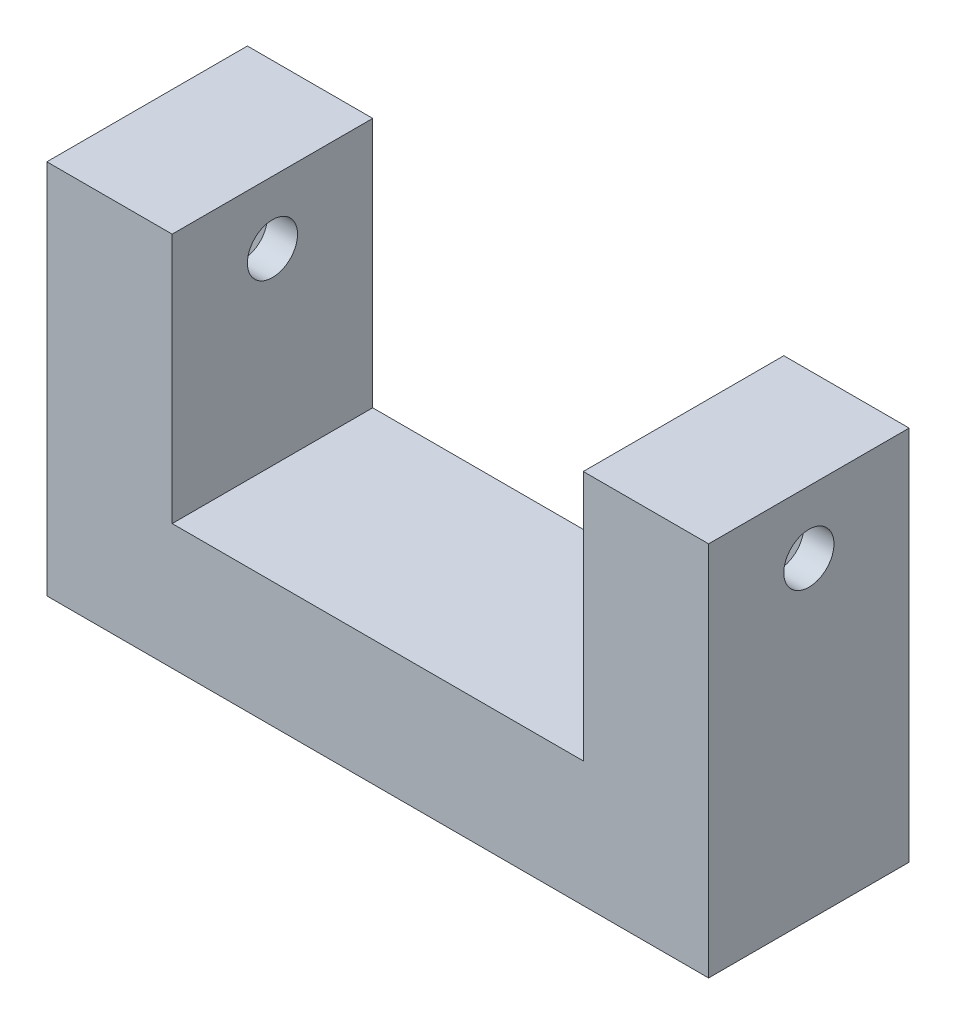
ISO-10303-21;
HEADER;
FILE_DESCRIPTION(('STEP AP214'),'2;1');
FILE_NAME('part.step','',(''),(''),'','','');
FILE_SCHEMA(('AUTOMOTIVE_DESIGN { 1 0 10303 214 1 1 1 1 }'));
ENDSEC;
DATA;
#1=APPLICATION_CONTEXT('core data for automotive mechanical design processes');
#2=APPLICATION_PROTOCOL_DEFINITION('international standard','automotive_design',2000,#1);
#3=PRODUCT_CONTEXT('',#1,'mechanical');
#4=PRODUCT('Part','Part','',(#3));
#5=PRODUCT_RELATED_PRODUCT_CATEGORY('part','',(#4));
#6=PRODUCT_DEFINITION_FORMATION('','',#4);
#7=PRODUCT_DEFINITION_CONTEXT('part definition',#1,'design');
#8=PRODUCT_DEFINITION('design','',#6,#7);
#9=PRODUCT_DEFINITION_SHAPE('','',#8);
#10=(LENGTH_UNIT() NAMED_UNIT(*) SI_UNIT(.MILLI.,.METRE.));
#11=(NAMED_UNIT(*) PLANE_ANGLE_UNIT() SI_UNIT($,.RADIAN.));
#12=(NAMED_UNIT(*) SI_UNIT($,.STERADIAN.) SOLID_ANGLE_UNIT());
#13=UNCERTAINTY_MEASURE_WITH_UNIT(LENGTH_MEASURE(1.E-05),#10,'distance_accuracy_value','');
#14=(GEOMETRIC_REPRESENTATION_CONTEXT(3) GLOBAL_UNCERTAINTY_ASSIGNED_CONTEXT((#13)) GLOBAL_UNIT_ASSIGNED_CONTEXT((#10,
#11,#12)) REPRESENTATION_CONTEXT('',''));
#15=CARTESIAN_POINT('',(0.,0.,0.));
#16=DIRECTION('',(0.,0.,1.));
#17=DIRECTION('',(1.,0.,0.));
#18=AXIS2_PLACEMENT_3D('',#15,#16,#17);
#19=CARTESIAN_POINT('',(21.4,0.,8.));
#20=DIRECTION('',(-1.,0.,0.));
#21=DIRECTION('',(0.,0.,1.));
#22=AXIS2_PLACEMENT_3D('',#19,#20,#21);
#23=PLANE('',#22);
#24=CARTESIAN_POINT('',(21.4,7.5,4.));
#25=DIRECTION('',(1.,0.,0.));
#26=DIRECTION('',(0.,0.,-1.));
#27=AXIS2_PLACEMENT_3D('',#24,#25,#26);
#28=CIRCLE('',#27,1.);
#29=CARTESIAN_POINT('',(21.4,7.5,3.));
#30=VERTEX_POINT('',#29);
#31=EDGE_CURVE('E338',#30,#30,#28,.T.);
#32=ORIENTED_EDGE('',*,*,#31,.F.);
#33=EDGE_LOOP('',(#32));
#34=FACE_BOUND('',#33,.T.);
#35=DIRECTION('',(0.,1.,0.));
#36=VECTOR('',#35,1.);
#37=CARTESIAN_POINT('',(21.4,0.,0.));
#38=LINE('',#37,#36);
#39=CARTESIAN_POINT('',(21.4,-5.,0.));
#40=VERTEX_POINT('',#39);
#41=CARTESIAN_POINT('',(21.4,10.,0.));
#42=VERTEX_POINT('',#41);
#43=EDGE_CURVE('E212',#40,#42,#38,.T.);
#44=ORIENTED_EDGE('',*,*,#43,.T.);
#45=DIRECTION('',(0.,0.,-1.));
#46=VECTOR('',#45,1.);
#47=CARTESIAN_POINT('',(21.4,10.,8.));
#48=LINE('',#47,#46);
#49=CARTESIAN_POINT('',(21.4,10.,8.));
#50=VERTEX_POINT('',#49);
#51=EDGE_CURVE('E289',#50,#42,#48,.T.);
#52=ORIENTED_EDGE('',*,*,#51,.F.);
#53=DIRECTION('',(0.,1.,0.));
#54=VECTOR('',#53,1.);
#55=CARTESIAN_POINT('',(21.4,0.,8.));
#56=LINE('',#55,#54);
#57=CARTESIAN_POINT('',(21.4,-5.,8.));
#58=VERTEX_POINT('',#57);
#59=EDGE_CURVE('E233',#58,#50,#56,.T.);
#60=ORIENTED_EDGE('',*,*,#59,.F.);
#61=DIRECTION('',(0.,0.,-1.));
#62=VECTOR('',#61,1.);
#63=CARTESIAN_POINT('',(21.4,-5.,8.));
#64=LINE('',#63,#62);
#65=EDGE_CURVE('E253',#58,#40,#64,.T.);
#66=ORIENTED_EDGE('',*,*,#65,.T.);
#67=EDGE_LOOP('',(#44,#52,#60,#66));
#68=FACE_BOUND('',#67,.T.);
#69=ADVANCED_FACE('F36',(#34,#68),#23,.F.);
#70=CARTESIAN_POINT('',(0.,10.,8.));
#71=DIRECTION('',(0.,-1.,0.));
#72=DIRECTION('',(1.,0.,0.));
#73=AXIS2_PLACEMENT_3D('',#70,#71,#72);
#74=PLANE('',#73);
#75=DIRECTION('',(-1.,0.,0.));
#76=VECTOR('',#75,1.);
#77=CARTESIAN_POINT('',(0.,10.,0.));
#78=LINE('',#77,#76);
#79=CARTESIAN_POINT('',(16.4,10.,0.));
#80=VERTEX_POINT('',#79);
#81=EDGE_CURVE('E256',#42,#80,#78,.T.);
#82=ORIENTED_EDGE('',*,*,#81,.T.);
#83=DIRECTION('',(0.,0.,-1.));
#84=VECTOR('',#83,1.);
#85=CARTESIAN_POINT('',(16.4,10.,8.));
#86=LINE('',#85,#84);
#87=CARTESIAN_POINT('',(16.4,10.,8.));
#88=VERTEX_POINT('',#87);
#89=EDGE_CURVE('E287',#88,#80,#86,.T.);
#90=ORIENTED_EDGE('',*,*,#89,.F.);
#91=DIRECTION('',(-1.,0.,0.));
#92=VECTOR('',#91,1.);
#93=CARTESIAN_POINT('',(0.,10.,8.));
#94=LINE('',#93,#92);
#95=EDGE_CURVE('E236',#50,#88,#94,.T.);
#96=ORIENTED_EDGE('',*,*,#95,.F.);
#97=ORIENTED_EDGE('',*,*,#51,.T.);
#98=EDGE_LOOP('',(#82,#90,#96,#97));
#99=FACE_BOUND('',#98,.T.);
#100=ADVANCED_FACE('F391',(#99),#74,.F.);
#101=CARTESIAN_POINT('',(16.4,0.,8.));
#102=DIRECTION('',(-1.,0.,0.));
#103=DIRECTION('',(0.,0.,1.));
#104=AXIS2_PLACEMENT_3D('',#101,#102,#103);
#105=PLANE('',#104);
#106=CARTESIAN_POINT('',(16.4,7.5,4.));
#107=DIRECTION('',(-1.,0.,0.));
#108=DIRECTION('',(0.,0.,1.));
#109=AXIS2_PLACEMENT_3D('',#106,#107,#108);
#110=CIRCLE('',#109,1.);
#111=CARTESIAN_POINT('',(16.4,7.5,5.));
#112=VERTEX_POINT('',#111);
#113=EDGE_CURVE('E206',#112,#112,#110,.T.);
#114=ORIENTED_EDGE('',*,*,#113,.F.);
#115=EDGE_LOOP('',(#114));
#116=FACE_BOUND('',#115,.T.);
#117=DIRECTION('',(0.,1.,0.));
#118=VECTOR('',#117,1.);
#119=CARTESIAN_POINT('',(16.4,0.,0.));
#120=LINE('',#119,#118);
#121=CARTESIAN_POINT('',(16.4,0.,0.));
#122=VERTEX_POINT('',#121);
#123=EDGE_CURVE('E259',#122,#80,#120,.T.);
#124=ORIENTED_EDGE('',*,*,#123,.F.);
#125=DIRECTION('',(0.,0.,-1.));
#126=VECTOR('',#125,1.);
#127=CARTESIAN_POINT('',(16.4,0.,8.));
#128=LINE('',#127,#126);
#129=CARTESIAN_POINT('',(16.4,0.,8.));
#130=VERTEX_POINT('',#129);
#131=EDGE_CURVE('E285',#130,#122,#128,.T.);
#132=ORIENTED_EDGE('',*,*,#131,.F.);
#133=DIRECTION('',(0.,1.,0.));
#134=VECTOR('',#133,1.);
#135=CARTESIAN_POINT('',(16.4,0.,8.));
#136=LINE('',#135,#134);
#137=EDGE_CURVE('E239',#130,#88,#136,.T.);
#138=ORIENTED_EDGE('',*,*,#137,.T.);
#139=ORIENTED_EDGE('',*,*,#89,.T.);
#140=EDGE_LOOP('',(#124,#132,#138,#139));
#141=FACE_BOUND('',#140,.T.);
#142=ADVANCED_FACE('F411',(#116,#141),#105,.T.);
#143=CARTESIAN_POINT('',(0.,0.,8.));
#144=DIRECTION('',(0.,1.,0.));
#145=DIRECTION('',(0.,0.,1.));
#146=AXIS2_PLACEMENT_3D('',#143,#144,#145);
#147=PLANE('',#146);
#148=DIRECTION('',(1.,0.,0.));
#149=VECTOR('',#148,1.);
#150=CARTESIAN_POINT('',(0.,0.,0.));
#151=LINE('',#150,#149);
#152=CARTESIAN_POINT('',(0.,0.,0.));
#153=VERTEX_POINT('',#152);
#154=EDGE_CURVE('E262',#153,#122,#151,.T.);
#155=ORIENTED_EDGE('',*,*,#154,.F.);
#156=DIRECTION('',(0.,0.,-1.));
#157=VECTOR('',#156,1.);
#158=CARTESIAN_POINT('',(0.,0.,8.));
#159=LINE('',#158,#157);
#160=CARTESIAN_POINT('',(0.,0.,8.));
#161=VERTEX_POINT('',#160);
#162=EDGE_CURVE('E283',#161,#153,#159,.T.);
#163=ORIENTED_EDGE('',*,*,#162,.F.);
#164=DIRECTION('',(1.,0.,0.));
#165=VECTOR('',#164,1.);
#166=CARTESIAN_POINT('',(0.,0.,8.));
#167=LINE('',#166,#165);
#168=EDGE_CURVE('E242',#161,#130,#167,.T.);
#169=ORIENTED_EDGE('',*,*,#168,.T.);
#170=ORIENTED_EDGE('',*,*,#131,.T.);
#171=EDGE_LOOP('',(#155,#163,#169,#170));
#172=FACE_BOUND('',#171,.T.);
#173=ADVANCED_FACE('F409',(#172),#147,.T.);
#174=CARTESIAN_POINT('',(0.,0.,8.));
#175=DIRECTION('',(-1.,0.,0.));
#176=DIRECTION('',(0.,0.,1.));
#177=AXIS2_PLACEMENT_3D('',#174,#175,#176);
#178=PLANE('',#177);
#179=CARTESIAN_POINT('',(0.,7.5,4.));
#180=DIRECTION('',(-1.,0.,0.));
#181=DIRECTION('',(0.,0.,1.));
#182=AXIS2_PLACEMENT_3D('',#179,#180,#181);
#183=CIRCLE('',#182,1.);
#184=CARTESIAN_POINT('',(0.,7.5,5.));
#185=VERTEX_POINT('',#184);
#186=EDGE_CURVE('E717',#185,#185,#183,.T.);
#187=ORIENTED_EDGE('',*,*,#186,.T.);
#188=EDGE_LOOP('',(#187));
#189=FACE_BOUND('',#188,.T.);
#190=DIRECTION('',(0.,1.,0.));
#191=VECTOR('',#190,1.);
#192=CARTESIAN_POINT('',(0.,0.,0.));
#193=LINE('',#192,#191);
#194=CARTESIAN_POINT('',(0.,10.,0.));
#195=VERTEX_POINT('',#194);
#196=EDGE_CURVE('E265',#153,#195,#193,.T.);
#197=ORIENTED_EDGE('',*,*,#196,.T.);
#198=DIRECTION('',(0.,0.,-1.));
#199=VECTOR('',#198,1.);
#200=CARTESIAN_POINT('',(0.,10.,8.));
#201=LINE('',#200,#199);
#202=CARTESIAN_POINT('',(0.,10.,8.));
#203=VERTEX_POINT('',#202);
#204=EDGE_CURVE('E280',#203,#195,#201,.T.);
#205=ORIENTED_EDGE('',*,*,#204,.F.);
#206=DIRECTION('',(0.,1.,0.));
#207=VECTOR('',#206,1.);
#208=CARTESIAN_POINT('',(0.,0.,8.));
#209=LINE('',#208,#207);
#210=EDGE_CURVE('E245',#161,#203,#209,.T.);
#211=ORIENTED_EDGE('',*,*,#210,.F.);
#212=ORIENTED_EDGE('',*,*,#162,.T.);
#213=EDGE_LOOP('',(#197,#205,#211,#212));
#214=FACE_BOUND('',#213,.T.);
#215=ADVANCED_FACE('F406',(#189,#214),#178,.F.);
#216=CARTESIAN_POINT('',(0.,10.,8.));
#217=DIRECTION('',(0.,-1.,0.));
#218=DIRECTION('',(0.,0.,-1.));
#219=AXIS2_PLACEMENT_3D('',#216,#217,#218);
#220=PLANE('',#219);
#221=DIRECTION('',(-1.,0.,0.));
#222=VECTOR('',#221,1.);
#223=CARTESIAN_POINT('',(0.,10.,0.));
#224=LINE('',#223,#222);
#225=CARTESIAN_POINT('',(-5.,10.,0.));
#226=VERTEX_POINT('',#225);
#227=EDGE_CURVE('E267',#195,#226,#224,.T.);
#228=ORIENTED_EDGE('',*,*,#227,.T.);
#229=DIRECTION('',(0.,0.,-1.));
#230=VECTOR('',#229,1.);
#231=CARTESIAN_POINT('',(-5.,10.,8.));
#232=LINE('',#231,#230);
#233=CARTESIAN_POINT('',(-5.,10.,8.));
#234=VERTEX_POINT('',#233);
#235=EDGE_CURVE('E277',#234,#226,#232,.T.);
#236=ORIENTED_EDGE('',*,*,#235,.F.);
#237=DIRECTION('',(-1.,0.,0.));
#238=VECTOR('',#237,1.);
#239=CARTESIAN_POINT('',(0.,10.,8.));
#240=LINE('',#239,#238);
#241=EDGE_CURVE('E247',#203,#234,#240,.T.);
#242=ORIENTED_EDGE('',*,*,#241,.F.);
#243=ORIENTED_EDGE('',*,*,#204,.T.);
#244=EDGE_LOOP('',(#228,#236,#242,#243));
#245=FACE_BOUND('',#244,.T.);
#246=ADVANCED_FACE('F402',(#245),#220,.F.);
#247=CARTESIAN_POINT('',(-5.,0.,8.));
#248=DIRECTION('',(1.,0.,0.));
#249=DIRECTION('',(0.,1.,0.));
#250=AXIS2_PLACEMENT_3D('',#247,#248,#249);
#251=PLANE('',#250);
#252=CARTESIAN_POINT('',(-5.,7.5,4.));
#253=DIRECTION('',(1.,0.,0.));
#254=DIRECTION('',(0.,0.,-1.));
#255=AXIS2_PLACEMENT_3D('',#252,#253,#254);
#256=CIRCLE('',#255,1.);
#257=CARTESIAN_POINT('',(-5.,7.5,3.));
#258=VERTEX_POINT('',#257);
#259=EDGE_CURVE('E297',#258,#258,#256,.T.);
#260=ORIENTED_EDGE('',*,*,#259,.T.);
#261=EDGE_LOOP('',(#260));
#262=FACE_BOUND('',#261,.T.);
#263=DIRECTION('',(0.,-1.,0.));
#264=VECTOR('',#263,1.);
#265=CARTESIAN_POINT('',(-5.,0.,0.));
#266=LINE('',#265,#264);
#267=CARTESIAN_POINT('',(-5.,-5.,0.));
#268=VERTEX_POINT('',#267);
#269=EDGE_CURVE('E269',#226,#268,#266,.T.);
#270=ORIENTED_EDGE('',*,*,#269,.T.);
#271=DIRECTION('',(0.,0.,-1.));
#272=VECTOR('',#271,1.);
#273=CARTESIAN_POINT('',(-5.,-5.,8.));
#274=LINE('',#273,#272);
#275=CARTESIAN_POINT('',(-5.,-5.,8.));
#276=VERTEX_POINT('',#275);
#277=EDGE_CURVE('E274',#276,#268,#274,.T.);
#278=ORIENTED_EDGE('',*,*,#277,.F.);
#279=DIRECTION('',(0.,-1.,0.));
#280=VECTOR('',#279,1.);
#281=CARTESIAN_POINT('',(-5.,0.,8.));
#282=LINE('',#281,#280);
#283=EDGE_CURVE('E249',#234,#276,#282,.T.);
#284=ORIENTED_EDGE('',*,*,#283,.F.);
#285=ORIENTED_EDGE('',*,*,#235,.T.);
#286=EDGE_LOOP('',(#270,#278,#284,#285));
#287=FACE_BOUND('',#286,.T.);
#288=ADVANCED_FACE('F374',(#262,#287),#251,.F.);
#289=CARTESIAN_POINT('',(0.,-5.,8.));
#290=DIRECTION('',(0.,1.,0.));
#291=DIRECTION('',(-1.,0.,0.));
#292=AXIS2_PLACEMENT_3D('',#289,#290,#291);
#293=PLANE('',#292);
#294=DIRECTION('',(0.,0.,1.));
#295=VECTOR('',#294,1.);
#296=CARTESIAN_POINT('',(-3.99999999999999,-5.,8.));
#297=LINE('',#296,#295);
#298=CARTESIAN_POINT('',(-3.99999999999999,-5.,1.45));
#299=VERTEX_POINT('',#298);
#300=CARTESIAN_POINT('',(-3.99999999999999,-5.,6.55));
#301=VERTEX_POINT('',#300);
#302=EDGE_CURVE('E310',#299,#301,#297,.T.);
#303=ORIENTED_EDGE('',*,*,#302,.T.);
#304=DIRECTION('',(1.,0.,0.));
#305=VECTOR('',#304,1.);
#306=CARTESIAN_POINT('',(0.,-5.,6.55));
#307=LINE('',#306,#305);
#308=CARTESIAN_POINT('',(-1.,-5.,6.55));
#309=VERTEX_POINT('',#308);
#310=EDGE_CURVE('E312',#301,#309,#307,.T.);
#311=ORIENTED_EDGE('',*,*,#310,.T.);
#312=DIRECTION('',(0.,0.,-1.));
#313=VECTOR('',#312,1.);
#314=CARTESIAN_POINT('',(-1.,-5.,8.));
#315=LINE('',#314,#313);
#316=CARTESIAN_POINT('',(-1.,-5.,1.45));
#317=VERTEX_POINT('',#316);
#318=EDGE_CURVE('E306',#309,#317,#315,.T.);
#319=ORIENTED_EDGE('',*,*,#318,.T.);
#320=DIRECTION('',(-1.,0.,0.));
#321=VECTOR('',#320,1.);
#322=CARTESIAN_POINT('',(0.,-5.,1.45));
#323=LINE('',#322,#321);
#324=EDGE_CURVE('E308',#317,#299,#323,.T.);
#325=ORIENTED_EDGE('',*,*,#324,.T.);
#326=EDGE_LOOP('',(#303,#311,#319,#325));
#327=FACE_BOUND('',#326,.T.);
#328=DIRECTION('',(0.,0.,1.));
#329=VECTOR('',#328,1.);
#330=CARTESIAN_POINT('',(17.4,-5.,8.));
#331=LINE('',#330,#329);
#332=CARTESIAN_POINT('',(17.4,-5.,1.45000000000001));
#333=VERTEX_POINT('',#332);
#334=CARTESIAN_POINT('',(17.4,-5.,6.55));
#335=VERTEX_POINT('',#334);
#336=EDGE_CURVE('E301',#333,#335,#331,.T.);
#337=ORIENTED_EDGE('',*,*,#336,.T.);
#338=DIRECTION('',(1.,0.,0.));
#339=VECTOR('',#338,1.);
#340=CARTESIAN_POINT('',(0.,-5.,6.55));
#341=LINE('',#340,#339);
#342=CARTESIAN_POINT('',(20.4,-5.,6.55));
#343=VERTEX_POINT('',#342);
#344=EDGE_CURVE('E303',#335,#343,#341,.T.);
#345=ORIENTED_EDGE('',*,*,#344,.T.);
#346=DIRECTION('',(0.,0.,-1.));
#347=VECTOR('',#346,1.);
#348=CARTESIAN_POINT('',(20.4,-5.,8.));
#349=LINE('',#348,#347);
#350=CARTESIAN_POINT('',(20.4,-5.,1.45000000000001));
#351=VERTEX_POINT('',#350);
#352=EDGE_CURVE('E299',#343,#351,#349,.T.);
#353=ORIENTED_EDGE('',*,*,#352,.T.);
#354=DIRECTION('',(-1.,0.,0.));
#355=VECTOR('',#354,1.);
#356=CARTESIAN_POINT('',(0.,-5.,1.45000000000001));
#357=LINE('',#356,#355);
#358=EDGE_CURVE('E292',#351,#333,#357,.T.);
#359=ORIENTED_EDGE('',*,*,#358,.T.);
#360=EDGE_LOOP('',(#337,#345,#353,#359));
#361=FACE_BOUND('',#360,.T.);
#362=DIRECTION('',(1.,0.,0.));
#363=VECTOR('',#362,1.);
#364=CARTESIAN_POINT('',(0.,-5.,0.));
#365=LINE('',#364,#363);
#366=EDGE_CURVE('E237',#268,#40,#365,.T.);
#367=ORIENTED_EDGE('',*,*,#366,.T.);
#368=ORIENTED_EDGE('',*,*,#65,.F.);
#369=DIRECTION('',(1.,0.,0.));
#370=VECTOR('',#369,1.);
#371=CARTESIAN_POINT('',(0.,-5.,8.));
#372=LINE('',#371,#370);
#373=EDGE_CURVE('E251',#276,#58,#372,.T.);
#374=ORIENTED_EDGE('',*,*,#373,.F.);
#375=ORIENTED_EDGE('',*,*,#277,.T.);
#376=EDGE_LOOP('',(#367,#368,#374,#375));
#377=FACE_BOUND('',#376,.T.);
#378=ADVANCED_FACE('F370',(#327,#361,#377),#293,.F.);
#379=CARTESIAN_POINT('',(0.,0.,8.));
#380=DIRECTION('',(0.,0.,1.));
#381=DIRECTION('',(1.,0.,0.));
#382=AXIS2_PLACEMENT_3D('',#379,#380,#381);
#383=PLANE('',#382);
#384=ORIENTED_EDGE('',*,*,#59,.T.);
#385=ORIENTED_EDGE('',*,*,#95,.T.);
#386=ORIENTED_EDGE('',*,*,#137,.F.);
#387=ORIENTED_EDGE('',*,*,#168,.F.);
#388=ORIENTED_EDGE('',*,*,#210,.T.);
#389=ORIENTED_EDGE('',*,*,#241,.T.);
#390=ORIENTED_EDGE('',*,*,#283,.T.);
#391=ORIENTED_EDGE('',*,*,#373,.T.);
#392=EDGE_LOOP('',(#384,#385,#386,#387,#388,#389,#390,#391));
#393=FACE_BOUND('',#392,.T.);
#394=ADVANCED_FACE('F373',(#393),#383,.T.);
#395=CARTESIAN_POINT('',(0.,0.,0.));
#396=DIRECTION('',(0.,0.,1.));
#397=DIRECTION('',(1.,0.,0.));
#398=AXIS2_PLACEMENT_3D('',#395,#396,#397);
#399=PLANE('',#398);
#400=ORIENTED_EDGE('',*,*,#43,.F.);
#401=ORIENTED_EDGE('',*,*,#366,.F.);
#402=ORIENTED_EDGE('',*,*,#269,.F.);
#403=ORIENTED_EDGE('',*,*,#227,.F.);
#404=ORIENTED_EDGE('',*,*,#196,.F.);
#405=ORIENTED_EDGE('',*,*,#154,.T.);
#406=ORIENTED_EDGE('',*,*,#123,.T.);
#407=ORIENTED_EDGE('',*,*,#81,.F.);
#408=EDGE_LOOP('',(#400,#401,#402,#403,#404,#405,#406,#407));
#409=FACE_BOUND('',#408,.T.);
#410=ADVANCED_FACE('F387',(#409),#399,.F.);
#411=CARTESIAN_POINT('',(20.2,-5.,1.65));
#412=DIRECTION('',(1.,0.,0.));
#413=DIRECTION('',(0.,0.,-1.));
#414=AXIS2_PLACEMENT_3D('',#411,#412,#413);
#415=PLANE('',#414);
#416=CARTESIAN_POINT('',(20.2,7.5,4.));
#417=DIRECTION('',(1.,0.,0.));
#418=DIRECTION('',(0.,0.,-1.));
#419=AXIS2_PLACEMENT_3D('',#416,#417,#418);
#420=CIRCLE('',#419,1.);
#421=CARTESIAN_POINT('',(20.2,7.5,3.));
#422=VERTEX_POINT('',#421);
#423=EDGE_CURVE('E719',#422,#422,#420,.T.);
#424=ORIENTED_EDGE('',*,*,#423,.T.);
#425=EDGE_LOOP('',(#424));
#426=FACE_BOUND('',#425,.T.);
#427=DIRECTION('',(0.,1.,0.));
#428=VECTOR('',#427,1.);
#429=CARTESIAN_POINT('',(20.2,-5.,1.65));
#430=LINE('',#429,#428);
#431=CARTESIAN_POINT('',(20.2,-4.80000000000001,1.65));
#432=VERTEX_POINT('',#431);
#433=CARTESIAN_POINT('',(20.2,9.,1.65));
#434=VERTEX_POINT('',#433);
#435=EDGE_CURVE('E227',#432,#434,#430,.T.);
#436=ORIENTED_EDGE('',*,*,#435,.F.);
#437=DIRECTION('',(0.,0.,1.));
#438=VECTOR('',#437,1.);
#439=CARTESIAN_POINT('',(20.2,-4.80000000000001,1.65));
#440=LINE('',#439,#438);
#441=CARTESIAN_POINT('',(20.2,-4.80000000000001,6.35));
#442=VERTEX_POINT('',#441);
#443=EDGE_CURVE('E46',#432,#442,#440,.T.);
#444=ORIENTED_EDGE('',*,*,#443,.T.);
#445=DIRECTION('',(0.,1.,0.));
#446=VECTOR('',#445,1.);
#447=CARTESIAN_POINT('',(20.2,-5.,6.35));
#448=LINE('',#447,#446);
#449=CARTESIAN_POINT('',(20.2,9.,6.35));
#450=VERTEX_POINT('',#449);
#451=EDGE_CURVE('E201',#442,#450,#448,.T.);
#452=ORIENTED_EDGE('',*,*,#451,.T.);
#453=DIRECTION('',(0.,0.,-1.));
#454=VECTOR('',#453,1.);
#455=CARTESIAN_POINT('',(20.2,9.,1.65));
#456=LINE('',#455,#454);
#457=EDGE_CURVE('E216',#450,#434,#456,.T.);
#458=ORIENTED_EDGE('',*,*,#457,.T.);
#459=EDGE_LOOP('',(#436,#444,#452,#458));
#460=FACE_BOUND('',#459,.T.);
#461=ADVANCED_FACE('F360',(#426,#460),#415,.F.);
#462=CARTESIAN_POINT('',(17.6,-5.,6.35));
#463=DIRECTION('',(0.,0.,1.));
#464=DIRECTION('',(1.,0.,0.));
#465=AXIS2_PLACEMENT_3D('',#462,#463,#464);
#466=PLANE('',#465);
#467=ORIENTED_EDGE('',*,*,#451,.F.);
#468=DIRECTION('',(-1.,0.,0.));
#469=VECTOR('',#468,1.);
#470=CARTESIAN_POINT('',(17.6,-4.80000000000001,6.35));
#471=LINE('',#470,#469);
#472=CARTESIAN_POINT('',(17.6,-4.80000000000001,6.35));
#473=VERTEX_POINT('',#472);
#474=EDGE_CURVE('E323',#442,#473,#471,.T.);
#475=ORIENTED_EDGE('',*,*,#474,.T.);
#476=DIRECTION('',(0.,1.,0.));
#477=VECTOR('',#476,1.);
#478=CARTESIAN_POINT('',(17.6,-5.,6.35));
#479=LINE('',#478,#477);
#480=CARTESIAN_POINT('',(17.6,9.,6.35));
#481=VERTEX_POINT('',#480);
#482=EDGE_CURVE('E203',#473,#481,#479,.T.);
#483=ORIENTED_EDGE('',*,*,#482,.T.);
#484=DIRECTION('',(1.,0.,0.));
#485=VECTOR('',#484,1.);
#486=CARTESIAN_POINT('',(17.6,9.,6.35));
#487=LINE('',#486,#485);
#488=EDGE_CURVE('E225',#481,#450,#487,.T.);
#489=ORIENTED_EDGE('',*,*,#488,.T.);
#490=EDGE_LOOP('',(#467,#475,#483,#489));
#491=FACE_BOUND('',#490,.T.);
#492=ADVANCED_FACE('F364',(#491),#466,.F.);
#493=CARTESIAN_POINT('',(17.6,-5.,1.65));
#494=DIRECTION('',(-1.,0.,0.));
#495=DIRECTION('',(0.,0.,1.));
#496=AXIS2_PLACEMENT_3D('',#493,#494,#495);
#497=PLANE('',#496);
#498=CARTESIAN_POINT('',(17.6,7.5,4.));
#499=DIRECTION('',(-1.,0.,0.));
#500=DIRECTION('',(0.,0.,1.));
#501=AXIS2_PLACEMENT_3D('',#498,#499,#500);
#502=CIRCLE('',#501,1.);
#503=CARTESIAN_POINT('',(17.6,7.5,5.));
#504=VERTEX_POINT('',#503);
#505=EDGE_CURVE('E722',#504,#504,#502,.T.);
#506=ORIENTED_EDGE('',*,*,#505,.T.);
#507=EDGE_LOOP('',(#506));
#508=FACE_BOUND('',#507,.T.);
#509=ORIENTED_EDGE('',*,*,#482,.F.);
#510=DIRECTION('',(0.,0.,-1.));
#511=VECTOR('',#510,1.);
#512=CARTESIAN_POINT('',(17.6,-4.80000000000001,1.65));
#513=LINE('',#512,#511);
#514=CARTESIAN_POINT('',(17.6,-4.80000000000001,1.65));
#515=VERTEX_POINT('',#514);
#516=EDGE_CURVE('E60',#473,#515,#513,.T.);
#517=ORIENTED_EDGE('',*,*,#516,.T.);
#518=DIRECTION('',(0.,1.,0.));
#519=VECTOR('',#518,1.);
#520=CARTESIAN_POINT('',(17.6,-5.,1.65));
#521=LINE('',#520,#519);
#522=CARTESIAN_POINT('',(17.6,9.,1.65));
#523=VERTEX_POINT('',#522);
#524=EDGE_CURVE('E230',#515,#523,#521,.T.);
#525=ORIENTED_EDGE('',*,*,#524,.T.);
#526=DIRECTION('',(0.,0.,1.));
#527=VECTOR('',#526,1.);
#528=CARTESIAN_POINT('',(17.6,9.,1.65));
#529=LINE('',#528,#527);
#530=EDGE_CURVE('E222',#523,#481,#529,.T.);
#531=ORIENTED_EDGE('',*,*,#530,.T.);
#532=EDGE_LOOP('',(#509,#517,#525,#531));
#533=FACE_BOUND('',#532,.T.);
#534=ADVANCED_FACE('F573',(#508,#533),#497,.F.);
#535=CARTESIAN_POINT('',(17.6,-5.,1.65));
#536=DIRECTION('',(0.,0.,-1.));
#537=DIRECTION('',(-1.,0.,0.));
#538=AXIS2_PLACEMENT_3D('',#535,#536,#537);
#539=PLANE('',#538);
#540=ORIENTED_EDGE('',*,*,#524,.F.);
#541=DIRECTION('',(1.,0.,0.));
#542=VECTOR('',#541,1.);
#543=CARTESIAN_POINT('',(17.6,-4.80000000000001,1.65));
#544=LINE('',#543,#542);
#545=EDGE_CURVE('E11',#515,#432,#544,.T.);
#546=ORIENTED_EDGE('',*,*,#545,.T.);
#547=ORIENTED_EDGE('',*,*,#435,.T.);
#548=DIRECTION('',(-1.,0.,0.));
#549=VECTOR('',#548,1.);
#550=CARTESIAN_POINT('',(17.6,9.,1.65));
#551=LINE('',#550,#549);
#552=EDGE_CURVE('E219',#434,#523,#551,.T.);
#553=ORIENTED_EDGE('',*,*,#552,.T.);
#554=EDGE_LOOP('',(#540,#546,#547,#553));
#555=FACE_BOUND('',#554,.T.);
#556=ADVANCED_FACE('F565',(#555),#539,.F.);
#557=CARTESIAN_POINT('',(0.,9.,0.));
#558=DIRECTION('',(0.,1.,0.));
#559=DIRECTION('',(0.,0.,1.));
#560=AXIS2_PLACEMENT_3D('',#557,#558,#559);
#561=PLANE('',#560);
#562=ORIENTED_EDGE('',*,*,#457,.F.);
#563=ORIENTED_EDGE('',*,*,#488,.F.);
#564=ORIENTED_EDGE('',*,*,#530,.F.);
#565=ORIENTED_EDGE('',*,*,#552,.F.);
#566=EDGE_LOOP('',(#562,#563,#564,#565));
#567=FACE_BOUND('',#566,.T.);
#568=ADVANCED_FACE('F557',(#567),#561,.F.);
#569=CARTESIAN_POINT('',(-1.2,-5.,1.65));
#570=DIRECTION('',(1.,0.,0.));
#571=DIRECTION('',(0.,0.,-1.));
#572=AXIS2_PLACEMENT_3D('',#569,#570,#571);
#573=PLANE('',#572);
#574=CARTESIAN_POINT('',(-1.2,7.5,4.));
#575=DIRECTION('',(1.,0.,0.));
#576=DIRECTION('',(0.,0.,-1.));
#577=AXIS2_PLACEMENT_3D('',#574,#575,#576);
#578=CIRCLE('',#577,1.);
#579=CARTESIAN_POINT('',(-1.2,7.5,3.));
#580=VERTEX_POINT('',#579);
#581=EDGE_CURVE('E296',#580,#580,#578,.T.);
#582=ORIENTED_EDGE('',*,*,#581,.T.);
#583=EDGE_LOOP('',(#582));
#584=FACE_BOUND('',#583,.T.);
#585=DIRECTION('',(0.,1.,0.));
#586=VECTOR('',#585,1.);
#587=CARTESIAN_POINT('',(-1.2,-5.,1.65));
#588=LINE('',#587,#586);
#589=CARTESIAN_POINT('',(-1.2,-4.8,1.65));
#590=VERTEX_POINT('',#589);
#591=CARTESIAN_POINT('',(-1.2,9.,1.65));
#592=VERTEX_POINT('',#591);
#593=EDGE_CURVE('E175',#590,#592,#588,.T.);
#594=ORIENTED_EDGE('',*,*,#593,.F.);
#595=DIRECTION('',(0.,0.,1.));
#596=VECTOR('',#595,1.);
#597=CARTESIAN_POINT('',(-1.2,-4.8,1.65));
#598=LINE('',#597,#596);
#599=CARTESIAN_POINT('',(-1.2,-4.8,6.35));
#600=VERTEX_POINT('',#599);
#601=EDGE_CURVE('E321',#590,#600,#598,.T.);
#602=ORIENTED_EDGE('',*,*,#601,.T.);
#603=DIRECTION('',(0.,1.,0.));
#604=VECTOR('',#603,1.);
#605=CARTESIAN_POINT('',(-1.2,-5.,6.35));
#606=LINE('',#605,#604);
#607=CARTESIAN_POINT('',(-1.2,9.,6.35));
#608=VERTEX_POINT('',#607);
#609=EDGE_CURVE('E200',#600,#608,#606,.T.);
#610=ORIENTED_EDGE('',*,*,#609,.T.);
#611=DIRECTION('',(0.,0.,-1.));
#612=VECTOR('',#611,1.);
#613=CARTESIAN_POINT('',(-1.2,9.,1.65));
#614=LINE('',#613,#612);
#615=EDGE_CURVE('E193',#608,#592,#614,.T.);
#616=ORIENTED_EDGE('',*,*,#615,.T.);
#617=EDGE_LOOP('',(#594,#602,#610,#616));
#618=FACE_BOUND('',#617,.T.);
#619=ADVANCED_FACE('F198',(#584,#618),#573,.F.);
#620=CARTESIAN_POINT('',(-3.8,-5.,6.35));
#621=DIRECTION('',(0.,0.,1.));
#622=DIRECTION('',(1.,0.,0.));
#623=AXIS2_PLACEMENT_3D('',#620,#621,#622);
#624=PLANE('',#623);
#625=ORIENTED_EDGE('',*,*,#609,.F.);
#626=DIRECTION('',(-1.,0.,0.));
#627=VECTOR('',#626,1.);
#628=CARTESIAN_POINT('',(-3.8,-4.8,6.35));
#629=LINE('',#628,#627);
#630=CARTESIAN_POINT('',(-3.8,-4.8,6.35));
#631=VERTEX_POINT('',#630);
#632=EDGE_CURVE('E315',#600,#631,#629,.T.);
#633=ORIENTED_EDGE('',*,*,#632,.T.);
#634=DIRECTION('',(0.,1.,0.));
#635=VECTOR('',#634,1.);
#636=CARTESIAN_POINT('',(-3.8,-5.,6.35));
#637=LINE('',#636,#635);
#638=CARTESIAN_POINT('',(-3.8,9.,6.35));
#639=VERTEX_POINT('',#638);
#640=EDGE_CURVE('E213',#631,#639,#637,.T.);
#641=ORIENTED_EDGE('',*,*,#640,.T.);
#642=DIRECTION('',(1.,0.,0.));
#643=VECTOR('',#642,1.);
#644=CARTESIAN_POINT('',(-3.8,9.,6.35));
#645=LINE('',#644,#643);
#646=EDGE_CURVE('E186',#639,#608,#645,.T.);
#647=ORIENTED_EDGE('',*,*,#646,.T.);
#648=EDGE_LOOP('',(#625,#633,#641,#647));
#649=FACE_BOUND('',#648,.T.);
#650=ADVANCED_FACE('F542',(#649),#624,.F.);
#651=CARTESIAN_POINT('',(-3.8,-5.,1.65));
#652=DIRECTION('',(-1.,0.,0.));
#653=DIRECTION('',(0.,0.,1.));
#654=AXIS2_PLACEMENT_3D('',#651,#652,#653);
#655=PLANE('',#654);
#656=CARTESIAN_POINT('',(-3.8,7.5,4.));
#657=DIRECTION('',(-1.,0.,0.));
#658=DIRECTION('',(0.,0.,1.));
#659=AXIS2_PLACEMENT_3D('',#656,#657,#658);
#660=CIRCLE('',#659,1.);
#661=CARTESIAN_POINT('',(-3.8,7.5,5.));
#662=VERTEX_POINT('',#661);
#663=EDGE_CURVE('E293',#662,#662,#660,.T.);
#664=ORIENTED_EDGE('',*,*,#663,.T.);
#665=EDGE_LOOP('',(#664));
#666=FACE_BOUND('',#665,.T.);
#667=ORIENTED_EDGE('',*,*,#640,.F.);
#668=DIRECTION('',(0.,0.,-1.));
#669=VECTOR('',#668,1.);
#670=CARTESIAN_POINT('',(-3.8,-4.8,1.65));
#671=LINE('',#670,#669);
#672=CARTESIAN_POINT('',(-3.8,-4.8,1.65));
#673=VERTEX_POINT('',#672);
#674=EDGE_CURVE('E318',#631,#673,#671,.T.);
#675=ORIENTED_EDGE('',*,*,#674,.T.);
#676=DIRECTION('',(0.,1.,0.));
#677=VECTOR('',#676,1.);
#678=CARTESIAN_POINT('',(-3.8,-5.,1.65));
#679=LINE('',#678,#677);
#680=CARTESIAN_POINT('',(-3.8,9.,1.65));
#681=VERTEX_POINT('',#680);
#682=EDGE_CURVE('E185',#673,#681,#679,.T.);
#683=ORIENTED_EDGE('',*,*,#682,.T.);
#684=DIRECTION('',(0.,0.,1.));
#685=VECTOR('',#684,1.);
#686=CARTESIAN_POINT('',(-3.8,9.,1.65));
#687=LINE('',#686,#685);
#688=EDGE_CURVE('E196',#681,#639,#687,.T.);
#689=ORIENTED_EDGE('',*,*,#688,.T.);
#690=EDGE_LOOP('',(#667,#675,#683,#689));
#691=FACE_BOUND('',#690,.T.);
#692=ADVANCED_FACE('F535',(#666,#691),#655,.F.);
#693=CARTESIAN_POINT('',(-3.8,-5.,1.65));
#694=DIRECTION('',(0.,0.,-1.));
#695=DIRECTION('',(-1.,0.,0.));
#696=AXIS2_PLACEMENT_3D('',#693,#694,#695);
#697=PLANE('',#696);
#698=ORIENTED_EDGE('',*,*,#682,.F.);
#699=DIRECTION('',(1.,0.,0.));
#700=VECTOR('',#699,1.);
#701=CARTESIAN_POINT('',(-3.8,-4.8,1.65));
#702=LINE('',#701,#700);
#703=EDGE_CURVE('E181',#673,#590,#702,.T.);
#704=ORIENTED_EDGE('',*,*,#703,.T.);
#705=ORIENTED_EDGE('',*,*,#593,.T.);
#706=DIRECTION('',(-1.,0.,0.));
#707=VECTOR('',#706,1.);
#708=CARTESIAN_POINT('',(-3.8,9.,1.65));
#709=LINE('',#708,#707);
#710=EDGE_CURVE('E179',#592,#681,#709,.T.);
#711=ORIENTED_EDGE('',*,*,#710,.T.);
#712=EDGE_LOOP('',(#698,#704,#705,#711));
#713=FACE_BOUND('',#712,.T.);
#714=ADVANCED_FACE('F178',(#713),#697,.F.);
#715=CARTESIAN_POINT('',(0.,9.,0.));
#716=DIRECTION('',(0.,1.,0.));
#717=DIRECTION('',(0.,0.,1.));
#718=AXIS2_PLACEMENT_3D('',#715,#716,#717);
#719=PLANE('',#718);
#720=ORIENTED_EDGE('',*,*,#615,.F.);
#721=ORIENTED_EDGE('',*,*,#646,.F.);
#722=ORIENTED_EDGE('',*,*,#688,.F.);
#723=ORIENTED_EDGE('',*,*,#710,.F.);
#724=EDGE_LOOP('',(#720,#721,#722,#723));
#725=FACE_BOUND('',#724,.T.);
#726=ADVANCED_FACE('F191',(#725),#719,.F.);
#727=CARTESIAN_POINT('',(-5.,7.5,4.));
#728=DIRECTION('',(1.,0.,0.));
#729=DIRECTION('',(0.,0.,-1.));
#730=AXIS2_PLACEMENT_3D('',#727,#728,#729);
#731=CYLINDRICAL_SURFACE('',#730,1.);
#732=ORIENTED_EDGE('',*,*,#259,.F.);
#733=EDGE_LOOP('',(#732));
#734=FACE_BOUND('',#733,.T.);
#735=ORIENTED_EDGE('',*,*,#663,.F.);
#736=EDGE_LOOP('',(#735));
#737=FACE_BOUND('',#736,.T.);
#738=ADVANCED_FACE('F510',(#734,#737),#731,.F.);
#739=ORIENTED_EDGE('',*,*,#581,.F.);
#740=EDGE_LOOP('',(#739));
#741=FACE_BOUND('',#740,.T.);
#742=ORIENTED_EDGE('',*,*,#186,.F.);
#743=EDGE_LOOP('',(#742));
#744=FACE_BOUND('',#743,.T.);
#745=ADVANCED_FACE('F502',(#741,#744),#731,.F.);
#746=ORIENTED_EDGE('',*,*,#113,.T.);
#747=EDGE_LOOP('',(#746));
#748=FACE_BOUND('',#747,.T.);
#749=ORIENTED_EDGE('',*,*,#505,.F.);
#750=EDGE_LOOP('',(#749));
#751=FACE_BOUND('',#750,.T.);
#752=ADVANCED_FACE('F499',(#748,#751),#731,.F.);
#753=ORIENTED_EDGE('',*,*,#31,.T.);
#754=EDGE_LOOP('',(#753));
#755=FACE_BOUND('',#754,.T.);
#756=ORIENTED_EDGE('',*,*,#423,.F.);
#757=EDGE_LOOP('',(#756));
#758=FACE_BOUND('',#757,.T.);
#759=ADVANCED_FACE('F456',(#755,#758),#731,.F.);
#760=CARTESIAN_POINT('',(0.,-5.,1.45));
#761=DIRECTION('',(0.,0.707106781186548,-0.707106781186547));
#762=DIRECTION('',(-1.,0.,0.));
#763=AXIS2_PLACEMENT_3D('',#760,#761,#762);
#764=PLANE('',#763);
#765=DIRECTION('',(0.577350269189626,-0.577350269189626,-0.577350269189626));
#766=VECTOR('',#765,1.);
#767=CARTESIAN_POINT('',(-0.66666666666667,-5.33333333333333,1.11666666666667));
#768=LINE('',#767,#766);
#769=EDGE_CURVE('E332',#590,#317,#768,.T.);
#770=ORIENTED_EDGE('',*,*,#769,.F.);
#771=ORIENTED_EDGE('',*,*,#703,.F.);
#772=DIRECTION('',(-0.577350269189625,-0.577350269189626,-0.577350269189627));
#773=VECTOR('',#772,1.);
#774=CARTESIAN_POINT('',(-1.81666666666666,-2.81666666666666,3.63333333333334));
#775=LINE('',#774,#773);
#776=EDGE_CURVE('E335',#299,#673,#775,.F.);
#777=ORIENTED_EDGE('',*,*,#776,.F.);
#778=ORIENTED_EDGE('',*,*,#324,.F.);
#779=EDGE_LOOP('',(#770,#771,#777,#778));
#780=FACE_BOUND('',#779,.T.);
#781=ADVANCED_FACE('F450',(#780),#764,.F.);
#782=CARTESIAN_POINT('',(-3.99999999999999,-5.,8.));
#783=DIRECTION('',(-0.707106781186549,0.707106781186546,0.));
#784=DIRECTION('',(0.,0.,1.));
#785=AXIS2_PLACEMENT_3D('',#782,#783,#784);
#786=PLANE('',#785);
#787=ORIENTED_EDGE('',*,*,#776,.T.);
#788=ORIENTED_EDGE('',*,*,#674,.F.);
#789=DIRECTION('',(-0.577350269189624,-0.577350269189626,0.577350269189627));
#790=VECTOR('',#789,1.);
#791=CARTESIAN_POINT('',(-2.66666666666667,-3.66666666666667,5.21666666666667));
#792=LINE('',#791,#790);
#793=EDGE_CURVE('E330',#301,#631,#792,.F.);
#794=ORIENTED_EDGE('',*,*,#793,.F.);
#795=ORIENTED_EDGE('',*,*,#302,.F.);
#796=EDGE_LOOP('',(#787,#788,#794,#795));
#797=FACE_BOUND('',#796,.T.);
#798=ADVANCED_FACE('F443',(#797),#786,.F.);
#799=CARTESIAN_POINT('',(-1.,-5.,8.));
#800=DIRECTION('',(0.707106781186547,0.707106781186548,0.));
#801=DIRECTION('',(0.,0.,-1.));
#802=AXIS2_PLACEMENT_3D('',#799,#800,#801);
#803=PLANE('',#802);
#804=ORIENTED_EDGE('',*,*,#769,.T.);
#805=ORIENTED_EDGE('',*,*,#318,.F.);
#806=DIRECTION('',(-0.577350269189626,0.577350269189626,-0.577350269189626));
#807=VECTOR('',#806,1.);
#808=CARTESIAN_POINT('',(-0.66666666666667,-5.33333333333333,6.88333333333333));
#809=LINE('',#808,#807);
#810=EDGE_CURVE('E328',#600,#309,#809,.F.);
#811=ORIENTED_EDGE('',*,*,#810,.F.);
#812=ORIENTED_EDGE('',*,*,#601,.F.);
#813=EDGE_LOOP('',(#804,#805,#811,#812));
#814=FACE_BOUND('',#813,.T.);
#815=ADVANCED_FACE('F436',(#814),#803,.F.);
#816=CARTESIAN_POINT('',(0.,-5.,6.55));
#817=DIRECTION('',(0.,0.707106781186548,0.707106781186547));
#818=DIRECTION('',(1.,0.,0.));
#819=AXIS2_PLACEMENT_3D('',#816,#817,#818);
#820=PLANE('',#819);
#821=ORIENTED_EDGE('',*,*,#793,.T.);
#822=ORIENTED_EDGE('',*,*,#632,.F.);
#823=ORIENTED_EDGE('',*,*,#810,.T.);
#824=ORIENTED_EDGE('',*,*,#310,.F.);
#825=EDGE_LOOP('',(#821,#822,#823,#824));
#826=FACE_BOUND('',#825,.T.);
#827=ADVANCED_FACE('F430',(#826),#820,.F.);
#828=CARTESIAN_POINT('',(0.,-5.,1.45000000000001));
#829=DIRECTION('',(0.,0.707106781186548,-0.707106781186547));
#830=DIRECTION('',(-1.,0.,0.));
#831=AXIS2_PLACEMENT_3D('',#828,#829,#830);
#832=PLANE('',#831);
#833=DIRECTION('',(-0.577350269189626,0.577350269189626,0.577350269189626));
#834=VECTOR('',#833,1.);
#835=CARTESIAN_POINT('',(18.2166666666667,-2.81666666666667,3.63333333333334));
#836=LINE('',#835,#834);
#837=EDGE_CURVE('E342',#432,#351,#836,.F.);
#838=ORIENTED_EDGE('',*,*,#837,.F.);
#839=ORIENTED_EDGE('',*,*,#545,.F.);
#840=DIRECTION('',(-0.577350269189626,-0.577350269189626,-0.577350269189626));
#841=VECTOR('',#840,1.);
#842=CARTESIAN_POINT('',(19.5833333333333,-2.81666666666667,3.63333333333334));
#843=LINE('',#842,#841);
#844=EDGE_CURVE('E41',#333,#515,#843,.F.);
#845=ORIENTED_EDGE('',*,*,#844,.F.);
#846=ORIENTED_EDGE('',*,*,#358,.F.);
#847=EDGE_LOOP('',(#838,#839,#845,#846));
#848=FACE_BOUND('',#847,.T.);
#849=ADVANCED_FACE('F39',(#848),#832,.F.);
#850=CARTESIAN_POINT('',(17.4,-5.,8.));
#851=DIRECTION('',(-0.707106781186547,0.707106781186547,0.));
#852=DIRECTION('',(0.,0.,1.));
#853=AXIS2_PLACEMENT_3D('',#850,#851,#852);
#854=PLANE('',#853);
#855=ORIENTED_EDGE('',*,*,#844,.T.);
#856=ORIENTED_EDGE('',*,*,#516,.F.);
#857=DIRECTION('',(-0.577350269189626,-0.577350269189626,0.577350269189626));
#858=VECTOR('',#857,1.);
#859=CARTESIAN_POINT('',(11.6,-10.8,12.35));
#860=LINE('',#859,#858);
#861=EDGE_CURVE('E341',#335,#473,#860,.F.);
#862=ORIENTED_EDGE('',*,*,#861,.F.);
#863=ORIENTED_EDGE('',*,*,#336,.F.);
#864=EDGE_LOOP('',(#855,#856,#862,#863));
#865=FACE_BOUND('',#864,.T.);
#866=ADVANCED_FACE('F352',(#865),#854,.F.);
#867=CARTESIAN_POINT('',(20.4,-5.,8.));
#868=DIRECTION('',(0.707106781186547,0.707106781186547,0.));
#869=DIRECTION('',(0.,0.,-1.));
#870=AXIS2_PLACEMENT_3D('',#867,#868,#869);
#871=PLANE('',#870);
#872=ORIENTED_EDGE('',*,*,#837,.T.);
#873=ORIENTED_EDGE('',*,*,#352,.F.);
#874=DIRECTION('',(-0.577350269189626,0.577350269189626,-0.577350269189626));
#875=VECTOR('',#874,1.);
#876=CARTESIAN_POINT('',(13.6,1.79999999999999,-0.250000000000005));
#877=LINE('',#876,#875);
#878=EDGE_CURVE('E339',#442,#343,#877,.F.);
#879=ORIENTED_EDGE('',*,*,#878,.F.);
#880=ORIENTED_EDGE('',*,*,#443,.F.);
#881=EDGE_LOOP('',(#872,#873,#879,#880));
#882=FACE_BOUND('',#881,.T.);
#883=ADVANCED_FACE('F357',(#882),#871,.F.);
#884=CARTESIAN_POINT('',(0.,-5.,6.55));
#885=DIRECTION('',(0.,0.707106781186548,0.707106781186547));
#886=DIRECTION('',(1.,0.,0.));
#887=AXIS2_PLACEMENT_3D('',#884,#885,#886);
#888=PLANE('',#887);
#889=ORIENTED_EDGE('',*,*,#861,.T.);
#890=ORIENTED_EDGE('',*,*,#474,.F.);
#891=ORIENTED_EDGE('',*,*,#878,.T.);
#892=ORIENTED_EDGE('',*,*,#344,.F.);
#893=EDGE_LOOP('',(#889,#890,#891,#892));
#894=FACE_BOUND('',#893,.T.);
#895=ADVANCED_FACE('F367',(#894),#888,.F.);
#896=CLOSED_SHELL('',(#69,#100,#142,#173,#215,#246,#288,#378,#394,#410,#461,#492,#534,#556,#568,
#619,#650,#692,#714,#726,#738,#745,#752,#759,#781,#798,#815,#827,#849,#866,#883,#895));
#897=MANIFOLD_SOLID_BREP('B2',#896);
#898=ADVANCED_BREP_SHAPE_REPRESENTATION('',(#18,#897),#14);
#899=SHAPE_DEFINITION_REPRESENTATION(#9,#898);
ENDSEC;
END-ISO-10303-21;
